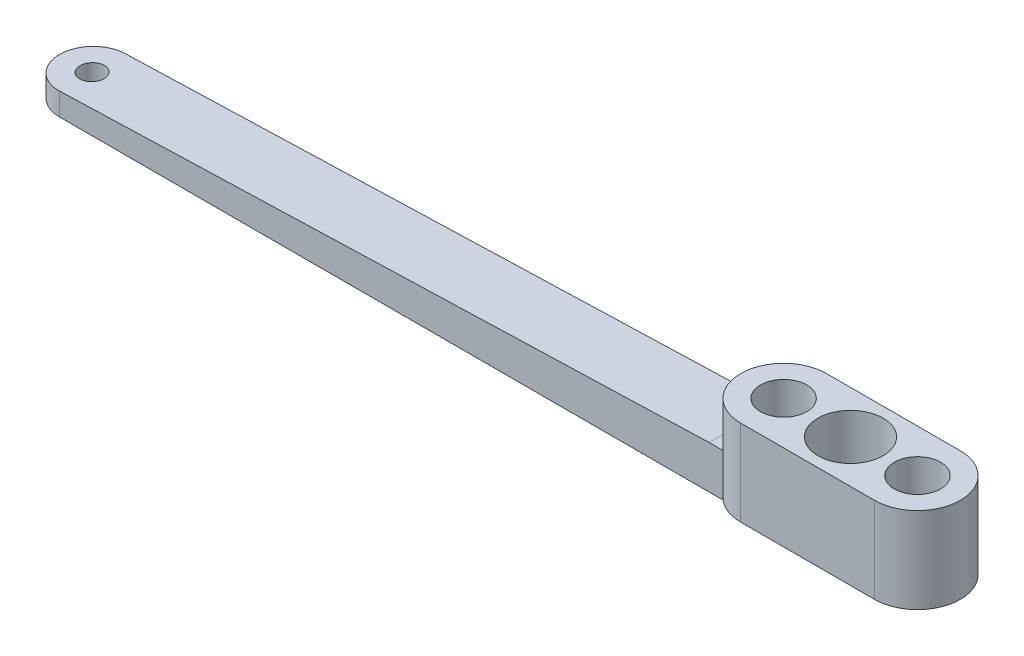
ISO-10303-21;
HEADER;
FILE_DESCRIPTION(('STEP AP214'),'2;1');
FILE_NAME('part.step','',(''),(''),'','','');
FILE_SCHEMA(('AUTOMOTIVE_DESIGN { 1 0 10303 214 1 1 1 1 }'));
ENDSEC;
DATA;
#1=APPLICATION_CONTEXT('core data for automotive mechanical design processes');
#2=APPLICATION_PROTOCOL_DEFINITION('international standard','automotive_design',2000,#1);
#3=PRODUCT_CONTEXT('',#1,'mechanical');
#4=PRODUCT('Part','Part','',(#3));
#5=PRODUCT_RELATED_PRODUCT_CATEGORY('part','',(#4));
#6=PRODUCT_DEFINITION_FORMATION('','',#4);
#7=PRODUCT_DEFINITION_CONTEXT('part definition',#1,'design');
#8=PRODUCT_DEFINITION('design','',#6,#7);
#9=PRODUCT_DEFINITION_SHAPE('','',#8);
#10=(LENGTH_UNIT() NAMED_UNIT(*) SI_UNIT(.MILLI.,.METRE.));
#11=(NAMED_UNIT(*) PLANE_ANGLE_UNIT() SI_UNIT($,.RADIAN.));
#12=(NAMED_UNIT(*) SI_UNIT($,.STERADIAN.) SOLID_ANGLE_UNIT());
#13=UNCERTAINTY_MEASURE_WITH_UNIT(LENGTH_MEASURE(1.E-05),#10,'distance_accuracy_value','');
#14=(GEOMETRIC_REPRESENTATION_CONTEXT(3) GLOBAL_UNCERTAINTY_ASSIGNED_CONTEXT((#13)) GLOBAL_UNIT_ASSIGNED_CONTEXT((#10,
#11,#12)) REPRESENTATION_CONTEXT('',''));
#15=CARTESIAN_POINT('',(0.,0.,0.));
#16=DIRECTION('',(0.,0.,1.));
#17=DIRECTION('',(1.,0.,0.));
#18=AXIS2_PLACEMENT_3D('',#15,#16,#17);
#19=CARTESIAN_POINT('',(0.,6.35,0.));
#20=DIRECTION('',(0.,1.,0.));
#21=DIRECTION('',(0.,0.,1.));
#22=AXIS2_PLACEMENT_3D('',#19,#20,#21);
#23=PLANE('',#22);
#24=DIRECTION('',(0.,0.,-1.));
#25=VECTOR('',#24,1.);
#26=CARTESIAN_POINT('',(-16.1103569011217,6.35,0.));
#27=LINE('',#26,#25);
#28=CARTESIAN_POINT('',(-16.1103569011217,6.35,4.82600000000001));
#29=VERTEX_POINT('',#28);
#30=CARTESIAN_POINT('',(-16.1103569011217,6.35,1.35220392082839));
#31=VERTEX_POINT('',#30);
#32=EDGE_CURVE('E11',#29,#31,#27,.T.);
#33=ORIENTED_EDGE('',*,*,#32,.F.);
#34=DIRECTION('',(1.,0.,0.));
#35=VECTOR('',#34,1.);
#36=CARTESIAN_POINT('',(0.,6.35,4.82600000000001));
#37=LINE('',#36,#35);
#38=CARTESIAN_POINT('',(-14.0330115095551,6.35,4.82600000000001));
#39=VERTEX_POINT('',#38);
#40=EDGE_CURVE('E63',#29,#39,#37,.T.);
#41=ORIENTED_EDGE('',*,*,#40,.T.);
#42=CARTESIAN_POINT('',(-9.906,6.35,0.));
#43=DIRECTION('',(0.,1.,0.));
#44=DIRECTION('',(0.,0.,1.));
#45=AXIS2_PLACEMENT_3D('',#42,#43,#44);
#46=CIRCLE('',#45,6.35);
#47=EDGE_CURVE('E149',#31,#39,#46,.T.);
#48=ORIENTED_EDGE('',*,*,#47,.F.);
#49=EDGE_LOOP('',(#33,#41,#48));
#50=FACE_BOUND('',#49,.T.);
#51=ADVANCED_FACE('F39',(#50),#23,.T.);
#52=CARTESIAN_POINT('',(-9.906,12.7,0.));
#53=DIRECTION('',(0.,1.,0.));
#54=DIRECTION('',(0.,0.,1.));
#55=AXIS2_PLACEMENT_3D('',#52,#53,#54);
#56=PLANE('',#55);
#57=CARTESIAN_POINT('',(9.906,12.7,0.));
#58=DIRECTION('',(0.,1.,0.));
#59=DIRECTION('',(0.,0.,1.));
#60=AXIS2_PLACEMENT_3D('',#57,#58,#59);
#61=CIRCLE('',#60,3.429);
#62=CARTESIAN_POINT('',(9.906,12.7,3.429));
#63=VERTEX_POINT('',#62);
#64=EDGE_CURVE('E193',#63,#63,#61,.T.);
#65=ORIENTED_EDGE('',*,*,#64,.F.);
#66=EDGE_LOOP('',(#65));
#67=FACE_BOUND('',#66,.T.);
#68=CARTESIAN_POINT('',(-9.906,12.7,0.));
#69=DIRECTION('',(0.,1.,0.));
#70=DIRECTION('',(0.,0.,1.));
#71=AXIS2_PLACEMENT_3D('',#68,#69,#70);
#72=CIRCLE('',#71,6.35);
#73=CARTESIAN_POINT('',(-9.906,12.7,-6.35));
#74=VERTEX_POINT('',#73);
#75=CARTESIAN_POINT('',(-9.906,12.7,6.35));
#76=VERTEX_POINT('',#75);
#77=EDGE_CURVE('E206',#74,#76,#72,.T.);
#78=ORIENTED_EDGE('',*,*,#77,.T.);
#79=DIRECTION('',(1.,0.,0.));
#80=VECTOR('',#79,1.);
#81=CARTESIAN_POINT('',(-9.906,12.7,6.35));
#82=LINE('',#81,#80);
#83=CARTESIAN_POINT('',(9.906,12.7,6.35));
#84=VERTEX_POINT('',#83);
#85=EDGE_CURVE('E210',#76,#84,#82,.T.);
#86=ORIENTED_EDGE('',*,*,#85,.T.);
#87=CARTESIAN_POINT('',(9.906,12.7,0.));
#88=DIRECTION('',(0.,1.,0.));
#89=DIRECTION('',(0.,0.,1.));
#90=AXIS2_PLACEMENT_3D('',#87,#88,#89);
#91=CIRCLE('',#90,6.35);
#92=CARTESIAN_POINT('',(9.906,12.7,-6.35));
#93=VERTEX_POINT('',#92);
#94=EDGE_CURVE('E214',#84,#93,#91,.T.);
#95=ORIENTED_EDGE('',*,*,#94,.T.);
#96=DIRECTION('',(-1.,0.,0.));
#97=VECTOR('',#96,1.);
#98=CARTESIAN_POINT('',(-9.906,12.7,-6.35));
#99=LINE('',#98,#97);
#100=EDGE_CURVE('E217',#93,#74,#99,.T.);
#101=ORIENTED_EDGE('',*,*,#100,.T.);
#102=EDGE_LOOP('',(#78,#86,#95,#101));
#103=FACE_BOUND('',#102,.T.);
#104=CARTESIAN_POINT('',(0.,12.7,0.));
#105=DIRECTION('',(0.,1.,0.));
#106=DIRECTION('',(0.,0.,1.));
#107=AXIS2_PLACEMENT_3D('',#104,#105,#106);
#108=CIRCLE('',#107,4.826);
#109=CARTESIAN_POINT('',(0.,12.7,4.826));
#110=VERTEX_POINT('',#109);
#111=EDGE_CURVE('E198',#110,#110,#108,.T.);
#112=ORIENTED_EDGE('',*,*,#111,.F.);
#113=EDGE_LOOP('',(#112));
#114=FACE_BOUND('',#113,.T.);
#115=CARTESIAN_POINT('',(-9.906,12.7,0.));
#116=DIRECTION('',(0.,1.,0.));
#117=DIRECTION('',(0.,0.,1.));
#118=AXIS2_PLACEMENT_3D('',#115,#116,#117);
#119=CIRCLE('',#118,3.429);
#120=CARTESIAN_POINT('',(-9.906,12.7,3.429));
#121=VERTEX_POINT('',#120);
#122=EDGE_CURVE('E186',#121,#121,#119,.T.);
#123=ORIENTED_EDGE('',*,*,#122,.F.);
#124=EDGE_LOOP('',(#123));
#125=FACE_BOUND('',#124,.T.);
#126=ADVANCED_FACE('F266',(#67,#103,#114,#125),#56,.T.);
#127=CARTESIAN_POINT('',(-9.906,0.,0.));
#128=DIRECTION('',(0.,1.,0.));
#129=DIRECTION('',(0.,0.,1.));
#130=AXIS2_PLACEMENT_3D('',#127,#128,#129);
#131=PLANE('',#130);
#132=CARTESIAN_POINT('',(-112.268,0.,0.));
#133=DIRECTION('',(0.,1.,0.));
#134=DIRECTION('',(0.,0.,1.));
#135=AXIS2_PLACEMENT_3D('',#132,#133,#134);
#136=CIRCLE('',#135,1.77800000000001);
#137=CARTESIAN_POINT('',(-112.268,0.,1.77800000000001));
#138=VERTEX_POINT('',#137);
#139=EDGE_CURVE('E377',#138,#138,#136,.T.);
#140=ORIENTED_EDGE('',*,*,#139,.T.);
#141=EDGE_LOOP('',(#140));
#142=FACE_BOUND('',#141,.T.);
#143=CARTESIAN_POINT('',(-9.906,0.,0.));
#144=DIRECTION('',(0.,1.,0.));
#145=DIRECTION('',(0.,0.,1.));
#146=AXIS2_PLACEMENT_3D('',#143,#144,#145);
#147=CIRCLE('',#146,6.35);
#148=CARTESIAN_POINT('',(-9.906,0.,-6.35));
#149=VERTEX_POINT('',#148);
#150=CARTESIAN_POINT('',(-14.0330115095551,0.,-4.82599999999999));
#151=VERTEX_POINT('',#150);
#152=EDGE_CURVE('E221',#149,#151,#147,.T.);
#153=ORIENTED_EDGE('',*,*,#152,.F.);
#154=DIRECTION('',(-1.,0.,0.));
#155=VECTOR('',#154,1.);
#156=CARTESIAN_POINT('',(-9.906,0.,-6.35));
#157=LINE('',#156,#155);
#158=CARTESIAN_POINT('',(9.906,0.,-6.35));
#159=VERTEX_POINT('',#158);
#160=EDGE_CURVE('E211',#159,#149,#157,.T.);
#161=ORIENTED_EDGE('',*,*,#160,.F.);
#162=CARTESIAN_POINT('',(9.906,0.,0.));
#163=DIRECTION('',(0.,1.,0.));
#164=DIRECTION('',(0.,0.,1.));
#165=AXIS2_PLACEMENT_3D('',#162,#163,#164);
#166=CIRCLE('',#165,6.35);
#167=CARTESIAN_POINT('',(9.906,0.,6.35));
#168=VERTEX_POINT('',#167);
#169=EDGE_CURVE('E227',#168,#159,#166,.T.);
#170=ORIENTED_EDGE('',*,*,#169,.F.);
#171=DIRECTION('',(1.,0.,0.));
#172=VECTOR('',#171,1.);
#173=CARTESIAN_POINT('',(-9.906,0.,6.35));
#174=LINE('',#173,#172);
#175=CARTESIAN_POINT('',(-9.906,0.,6.35));
#176=VERTEX_POINT('',#175);
#177=EDGE_CURVE('E224',#176,#168,#174,.T.);
#178=ORIENTED_EDGE('',*,*,#177,.F.);
#179=CARTESIAN_POINT('',(-14.0330115095551,0.,4.82600000000001));
#180=VERTEX_POINT('',#179);
#181=EDGE_CURVE('E202',#180,#176,#147,.T.);
#182=ORIENTED_EDGE('',*,*,#181,.F.);
#183=DIRECTION('',(1.,0.,0.));
#184=VECTOR('',#183,1.);
#185=CARTESIAN_POINT('',(0.,0.,4.82600000000001));
#186=LINE('',#185,#184);
#187=CARTESIAN_POINT('',(-112.268,0.,4.82600000000001));
#188=VERTEX_POINT('',#187);
#189=EDGE_CURVE('E158',#188,#180,#186,.T.);
#190=ORIENTED_EDGE('',*,*,#189,.F.);
#191=CARTESIAN_POINT('',(-112.268,0.,0.));
#192=DIRECTION('',(0.,1.,0.));
#193=DIRECTION('',(0.,0.,1.));
#194=AXIS2_PLACEMENT_3D('',#191,#192,#193);
#195=CIRCLE('',#194,4.826);
#196=CARTESIAN_POINT('',(-112.268,0.,-4.82599999999999));
#197=VERTEX_POINT('',#196);
#198=EDGE_CURVE('E154',#197,#188,#195,.T.);
#199=ORIENTED_EDGE('',*,*,#198,.F.);
#200=DIRECTION('',(1.,0.,0.));
#201=VECTOR('',#200,1.);
#202=CARTESIAN_POINT('',(0.,0.,-4.82599999999999));
#203=LINE('',#202,#201);
#204=EDGE_CURVE('E136',#197,#151,#203,.T.);
#205=ORIENTED_EDGE('',*,*,#204,.T.);
#206=EDGE_LOOP('',(#153,#161,#170,#178,#182,#190,#199,#205));
#207=FACE_BOUND('',#206,.T.);
#208=CARTESIAN_POINT('',(0.,0.,0.));
#209=DIRECTION('',(0.,1.,0.));
#210=DIRECTION('',(0.,0.,1.));
#211=AXIS2_PLACEMENT_3D('',#208,#209,#210);
#212=CIRCLE('',#211,4.826);
#213=CARTESIAN_POINT('',(0.,0.,4.826));
#214=VERTEX_POINT('',#213);
#215=EDGE_CURVE('E197',#214,#214,#212,.T.);
#216=ORIENTED_EDGE('',*,*,#215,.T.);
#217=EDGE_LOOP('',(#216));
#218=FACE_BOUND('',#217,.T.);
#219=CARTESIAN_POINT('',(-9.906,0.,0.));
#220=DIRECTION('',(0.,1.,0.));
#221=DIRECTION('',(0.,0.,1.));
#222=AXIS2_PLACEMENT_3D('',#219,#220,#221);
#223=CIRCLE('',#222,1.905);
#224=CARTESIAN_POINT('',(-9.906,0.,1.905));
#225=VERTEX_POINT('',#224);
#226=EDGE_CURVE('E178',#225,#225,#223,.T.);
#227=ORIENTED_EDGE('',*,*,#226,.T.);
#228=EDGE_LOOP('',(#227));
#229=FACE_BOUND('',#228,.T.);
#230=CARTESIAN_POINT('',(9.906,0.,0.));
#231=DIRECTION('',(0.,1.,0.));
#232=DIRECTION('',(0.,0.,1.));
#233=AXIS2_PLACEMENT_3D('',#230,#231,#232);
#234=CIRCLE('',#233,1.905);
#235=CARTESIAN_POINT('',(9.906,0.,1.905));
#236=VERTEX_POINT('',#235);
#237=EDGE_CURVE('E173',#236,#236,#234,.T.);
#238=ORIENTED_EDGE('',*,*,#237,.T.);
#239=EDGE_LOOP('',(#238));
#240=FACE_BOUND('',#239,.T.);
#241=ADVANCED_FACE('F269',(#142,#207,#218,#229,#240),#131,.F.);
#242=CARTESIAN_POINT('',(-9.906,12.7,0.));
#243=DIRECTION('',(0.,-1.,0.));
#244=DIRECTION('',(0.,0.,-1.));
#245=AXIS2_PLACEMENT_3D('',#242,#243,#244);
#246=CYLINDRICAL_SURFACE('',#245,6.35);
#247=ORIENTED_EDGE('',*,*,#152,.T.);
#248=DIRECTION('',(0.,-1.,0.));
#249=VECTOR('',#248,1.);
#250=CARTESIAN_POINT('',(-14.0330115095551,6.35,-4.82599999999999));
#251=LINE('',#250,#249);
#252=CARTESIAN_POINT('',(-14.0330115095551,6.35,-4.82599999999999));
#253=VERTEX_POINT('',#252);
#254=EDGE_CURVE('E170',#253,#151,#251,.T.);
#255=ORIENTED_EDGE('',*,*,#254,.F.);
#256=CARTESIAN_POINT('',(-16.1103569011217,6.35,-1.35220392082839));
#257=VERTEX_POINT('',#256);
#258=EDGE_CURVE('E140',#253,#257,#46,.T.);
#259=ORIENTED_EDGE('',*,*,#258,.T.);
#260=EDGE_CURVE('E147',#257,#31,#46,.T.);
#261=ORIENTED_EDGE('',*,*,#260,.T.);
#262=ORIENTED_EDGE('',*,*,#47,.T.);
#263=DIRECTION('',(0.,-1.,0.));
#264=VECTOR('',#263,1.);
#265=CARTESIAN_POINT('',(-14.0330115095551,6.35,4.82600000000001));
#266=LINE('',#265,#264);
#267=EDGE_CURVE('E145',#39,#180,#266,.T.);
#268=ORIENTED_EDGE('',*,*,#267,.T.);
#269=ORIENTED_EDGE('',*,*,#181,.T.);
#270=DIRECTION('',(0.,-1.,0.));
#271=VECTOR('',#270,1.);
#272=CARTESIAN_POINT('',(-9.906,12.7,6.35));
#273=LINE('',#272,#271);
#274=EDGE_CURVE('E243',#76,#176,#273,.T.);
#275=ORIENTED_EDGE('',*,*,#274,.F.);
#276=ORIENTED_EDGE('',*,*,#77,.F.);
#277=DIRECTION('',(0.,-1.,0.));
#278=VECTOR('',#277,1.);
#279=CARTESIAN_POINT('',(-9.906,12.7,-6.35));
#280=LINE('',#279,#278);
#281=EDGE_CURVE('E220',#74,#149,#280,.T.);
#282=ORIENTED_EDGE('',*,*,#281,.T.);
#283=EDGE_LOOP('',(#247,#255,#259,#261,#262,#268,#269,#275,#276,#282));
#284=FACE_BOUND('',#283,.T.);
#285=ADVANCED_FACE('F41',(#284),#246,.T.);
#286=CARTESIAN_POINT('',(-9.906,12.7,6.35));
#287=DIRECTION('',(0.,0.,-1.));
#288=DIRECTION('',(-1.,0.,0.));
#289=AXIS2_PLACEMENT_3D('',#286,#287,#288);
#290=PLANE('',#289);
#291=ORIENTED_EDGE('',*,*,#177,.T.);
#292=DIRECTION('',(0.,-1.,0.));
#293=VECTOR('',#292,1.);
#294=CARTESIAN_POINT('',(9.906,12.7,6.35));
#295=LINE('',#294,#293);
#296=EDGE_CURVE('E239',#84,#168,#295,.T.);
#297=ORIENTED_EDGE('',*,*,#296,.F.);
#298=ORIENTED_EDGE('',*,*,#85,.F.);
#299=ORIENTED_EDGE('',*,*,#274,.T.);
#300=EDGE_LOOP('',(#291,#297,#298,#299));
#301=FACE_BOUND('',#300,.T.);
#302=ADVANCED_FACE('F336',(#301),#290,.F.);
#303=CARTESIAN_POINT('',(9.906,12.7,0.));
#304=DIRECTION('',(0.,-1.,0.));
#305=DIRECTION('',(0.,0.,-1.));
#306=AXIS2_PLACEMENT_3D('',#303,#304,#305);
#307=CYLINDRICAL_SURFACE('',#306,6.35);
#308=ORIENTED_EDGE('',*,*,#169,.T.);
#309=DIRECTION('',(0.,-1.,0.));
#310=VECTOR('',#309,1.);
#311=CARTESIAN_POINT('',(9.906,12.7,-6.35));
#312=LINE('',#311,#310);
#313=EDGE_CURVE('E235',#93,#159,#312,.T.);
#314=ORIENTED_EDGE('',*,*,#313,.F.);
#315=ORIENTED_EDGE('',*,*,#94,.F.);
#316=ORIENTED_EDGE('',*,*,#296,.T.);
#317=EDGE_LOOP('',(#308,#314,#315,#316));
#318=FACE_BOUND('',#317,.T.);
#319=ADVANCED_FACE('F345',(#318),#307,.T.);
#320=CARTESIAN_POINT('',(-9.906,12.7,-6.35));
#321=DIRECTION('',(0.,0.,1.));
#322=DIRECTION('',(1.,0.,0.));
#323=AXIS2_PLACEMENT_3D('',#320,#321,#322);
#324=PLANE('',#323);
#325=ORIENTED_EDGE('',*,*,#160,.T.);
#326=ORIENTED_EDGE('',*,*,#281,.F.);
#327=ORIENTED_EDGE('',*,*,#100,.F.);
#328=ORIENTED_EDGE('',*,*,#313,.T.);
#329=EDGE_LOOP('',(#325,#326,#327,#328));
#330=FACE_BOUND('',#329,.T.);
#331=ADVANCED_FACE('F342',(#330),#324,.F.);
#332=CARTESIAN_POINT('',(0.,12.7,0.));
#333=DIRECTION('',(0.,-1.,0.));
#334=DIRECTION('',(0.,0.,-1.));
#335=AXIS2_PLACEMENT_3D('',#332,#333,#334);
#336=CYLINDRICAL_SURFACE('',#335,4.826);
#337=ORIENTED_EDGE('',*,*,#111,.T.);
#338=EDGE_LOOP('',(#337));
#339=FACE_BOUND('',#338,.T.);
#340=ORIENTED_EDGE('',*,*,#215,.F.);
#341=EDGE_LOOP('',(#340));
#342=FACE_BOUND('',#341,.T.);
#343=ADVANCED_FACE('F262',(#339,#342),#336,.F.);
#344=CARTESIAN_POINT('',(9.906,12.7,0.));
#345=DIRECTION('',(0.,-1.,0.));
#346=DIRECTION('',(0.,0.,-1.));
#347=AXIS2_PLACEMENT_3D('',#344,#345,#346);
#348=CYLINDRICAL_SURFACE('',#347,3.429);
#349=CARTESIAN_POINT('',(9.906,6.35,0.));
#350=DIRECTION('',(0.,1.,0.));
#351=DIRECTION('',(0.,0.,1.));
#352=AXIS2_PLACEMENT_3D('',#349,#350,#351);
#353=CIRCLE('',#352,3.429);
#354=CARTESIAN_POINT('',(9.906,6.35,3.429));
#355=VERTEX_POINT('',#354);
#356=EDGE_CURVE('E127',#355,#355,#353,.T.);
#357=ORIENTED_EDGE('',*,*,#356,.F.);
#358=EDGE_LOOP('',(#357));
#359=FACE_BOUND('',#358,.T.);
#360=ORIENTED_EDGE('',*,*,#64,.T.);
#361=EDGE_LOOP('',(#360));
#362=FACE_BOUND('',#361,.T.);
#363=ADVANCED_FACE('F258',(#359,#362),#348,.F.);
#364=CARTESIAN_POINT('',(-9.906,12.7,0.));
#365=DIRECTION('',(0.,-1.,0.));
#366=DIRECTION('',(0.,0.,-1.));
#367=AXIS2_PLACEMENT_3D('',#364,#365,#366);
#368=CYLINDRICAL_SURFACE('',#367,3.429);
#369=CARTESIAN_POINT('',(-9.906,6.35,0.));
#370=DIRECTION('',(0.,1.,0.));
#371=DIRECTION('',(0.,0.,1.));
#372=AXIS2_PLACEMENT_3D('',#369,#370,#371);
#373=CIRCLE('',#372,3.429);
#374=CARTESIAN_POINT('',(-9.906,6.35,3.429));
#375=VERTEX_POINT('',#374);
#376=EDGE_CURVE('E247',#375,#375,#373,.T.);
#377=ORIENTED_EDGE('',*,*,#376,.F.);
#378=EDGE_LOOP('',(#377));
#379=FACE_BOUND('',#378,.T.);
#380=ORIENTED_EDGE('',*,*,#122,.T.);
#381=EDGE_LOOP('',(#380));
#382=FACE_BOUND('',#381,.T.);
#383=ADVANCED_FACE('F261',(#379,#382),#368,.F.);
#384=CARTESIAN_POINT('',(-9.906,6.35,0.));
#385=DIRECTION('',(0.,1.,0.));
#386=DIRECTION('',(0.,0.,1.));
#387=AXIS2_PLACEMENT_3D('',#384,#385,#386);
#388=PLANE('',#387);
#389=ORIENTED_EDGE('',*,*,#376,.T.);
#390=EDGE_LOOP('',(#389));
#391=FACE_BOUND('',#390,.T.);
#392=CARTESIAN_POINT('',(-9.906,6.35,0.));
#393=DIRECTION('',(0.,1.,0.));
#394=DIRECTION('',(0.,0.,1.));
#395=AXIS2_PLACEMENT_3D('',#392,#393,#394);
#396=CIRCLE('',#395,1.905);
#397=CARTESIAN_POINT('',(-9.906,6.35,1.905));
#398=VERTEX_POINT('',#397);
#399=EDGE_CURVE('E182',#398,#398,#396,.T.);
#400=ORIENTED_EDGE('',*,*,#399,.F.);
#401=EDGE_LOOP('',(#400));
#402=FACE_BOUND('',#401,.T.);
#403=ADVANCED_FACE('F279',(#391,#402),#388,.T.);
#404=CARTESIAN_POINT('',(-9.906,6.35,0.));
#405=DIRECTION('',(0.,-1.,0.));
#406=DIRECTION('',(0.,0.,-1.));
#407=AXIS2_PLACEMENT_3D('',#404,#405,#406);
#408=CYLINDRICAL_SURFACE('',#407,1.905);
#409=ORIENTED_EDGE('',*,*,#399,.T.);
#410=EDGE_LOOP('',(#409));
#411=FACE_BOUND('',#410,.T.);
#412=ORIENTED_EDGE('',*,*,#226,.F.);
#413=EDGE_LOOP('',(#412));
#414=FACE_BOUND('',#413,.T.);
#415=ADVANCED_FACE('F285',(#411,#414),#408,.F.);
#416=CARTESIAN_POINT('',(9.906,6.35,0.));
#417=DIRECTION('',(0.,1.,0.));
#418=DIRECTION('',(0.,0.,1.));
#419=AXIS2_PLACEMENT_3D('',#416,#417,#418);
#420=PLANE('',#419);
#421=ORIENTED_EDGE('',*,*,#356,.T.);
#422=EDGE_LOOP('',(#421));
#423=FACE_BOUND('',#422,.T.);
#424=CARTESIAN_POINT('',(9.906,6.35,0.));
#425=DIRECTION('',(0.,1.,0.));
#426=DIRECTION('',(0.,0.,1.));
#427=AXIS2_PLACEMENT_3D('',#424,#425,#426);
#428=CIRCLE('',#427,1.905);
#429=CARTESIAN_POINT('',(9.906,6.35,1.905));
#430=VERTEX_POINT('',#429);
#431=EDGE_CURVE('E174',#430,#430,#428,.T.);
#432=ORIENTED_EDGE('',*,*,#431,.F.);
#433=EDGE_LOOP('',(#432));
#434=FACE_BOUND('',#433,.T.);
#435=ADVANCED_FACE('F255',(#423,#434),#420,.T.);
#436=CARTESIAN_POINT('',(9.906,6.35,0.));
#437=DIRECTION('',(0.,-1.,0.));
#438=DIRECTION('',(0.,0.,-1.));
#439=AXIS2_PLACEMENT_3D('',#436,#437,#438);
#440=CYLINDRICAL_SURFACE('',#439,1.905);
#441=ORIENTED_EDGE('',*,*,#431,.T.);
#442=EDGE_LOOP('',(#441));
#443=FACE_BOUND('',#442,.T.);
#444=ORIENTED_EDGE('',*,*,#237,.F.);
#445=EDGE_LOOP('',(#444));
#446=FACE_BOUND('',#445,.T.);
#447=ADVANCED_FACE('F313',(#443,#446),#440,.F.);
#448=CARTESIAN_POINT('',(0.,6.35,-4.82599999999999));
#449=DIRECTION('',(0.,0.,-1.));
#450=DIRECTION('',(-1.,0.,0.));
#451=AXIS2_PLACEMENT_3D('',#448,#449,#450);
#452=PLANE('',#451);
#453=DIRECTION('',(-0.999506106217205,-0.0314252069925062,0.));
#454=VECTOR('',#453,1.);
#455=CARTESIAN_POINT('',(-0.0159096804075781,6.85602125609325,-4.82599999999999));
#456=LINE('',#455,#454);
#457=CARTESIAN_POINT('',(-16.1103569011217,6.35,-4.82599999999999));
#458=VERTEX_POINT('',#457);
#459=CARTESIAN_POINT('',(-112.268,3.32673298892571,-4.82599999999999));
#460=VERTEX_POINT('',#459);
#461=EDGE_CURVE('E120',#458,#460,#456,.T.);
#462=ORIENTED_EDGE('',*,*,#461,.F.);
#463=DIRECTION('',(1.,0.,0.));
#464=VECTOR('',#463,1.);
#465=CARTESIAN_POINT('',(0.,6.35,-4.82599999999999));
#466=LINE('',#465,#464);
#467=EDGE_CURVE('E131',#458,#253,#466,.T.);
#468=ORIENTED_EDGE('',*,*,#467,.T.);
#469=ORIENTED_EDGE('',*,*,#254,.T.);
#470=ORIENTED_EDGE('',*,*,#204,.F.);
#471=DIRECTION('',(0.,-1.,0.));
#472=VECTOR('',#471,1.);
#473=CARTESIAN_POINT('',(-112.268,6.35,-4.82599999999999));
#474=LINE('',#473,#472);
#475=EDGE_CURVE('E134',#460,#197,#474,.T.);
#476=ORIENTED_EDGE('',*,*,#475,.F.);
#477=EDGE_LOOP('',(#462,#468,#469,#470,#476));
#478=FACE_BOUND('',#477,.T.);
#479=ADVANCED_FACE('F129',(#478),#452,.T.);
#480=CARTESIAN_POINT('',(-112.268,6.35,0.));
#481=DIRECTION('',(0.,-1.,0.));
#482=DIRECTION('',(0.,0.,-1.));
#483=AXIS2_PLACEMENT_3D('',#480,#481,#482);
#484=CYLINDRICAL_SURFACE('',#483,4.826);
#485=CARTESIAN_POINT('',(-112.268,3.32673298892571,0.));
#486=DIRECTION('',(0.0314252069925062,-0.999506106217205,0.));
#487=DIRECTION('',(-0.999506106217205,-0.0314252069925062,0.));
#488=AXIS2_PLACEMENT_3D('',#485,#486,#487);
#489=ELLIPSE('',#488,4.82838470918881,4.826);
#490=CARTESIAN_POINT('',(-112.268,3.32673298892571,4.82600000000001));
#491=VERTEX_POINT('',#490);
#492=EDGE_CURVE('E137',#491,#460,#489,.T.);
#493=ORIENTED_EDGE('',*,*,#492,.T.);
#494=ORIENTED_EDGE('',*,*,#475,.T.);
#495=ORIENTED_EDGE('',*,*,#198,.T.);
#496=DIRECTION('',(0.,-1.,0.));
#497=VECTOR('',#496,1.);
#498=CARTESIAN_POINT('',(-112.268,6.35,4.82600000000001));
#499=LINE('',#498,#497);
#500=EDGE_CURVE('E165',#491,#188,#499,.T.);
#501=ORIENTED_EDGE('',*,*,#500,.F.);
#502=EDGE_LOOP('',(#493,#494,#495,#501));
#503=FACE_BOUND('',#502,.T.);
#504=ADVANCED_FACE('F303',(#503),#484,.T.);
#505=CARTESIAN_POINT('',(0.,6.35,4.82600000000001));
#506=DIRECTION('',(0.,0.,-1.));
#507=DIRECTION('',(-1.,0.,0.));
#508=AXIS2_PLACEMENT_3D('',#505,#506,#507);
#509=PLANE('',#508);
#510=ORIENTED_EDGE('',*,*,#40,.F.);
#511=DIRECTION('',(-0.999506106217205,-0.0314252069925062,0.));
#512=VECTOR('',#511,1.);
#513=CARTESIAN_POINT('',(-0.0159096804075781,6.85602125609325,4.82600000000001));
#514=LINE('',#513,#512);
#515=EDGE_CURVE('E369',#29,#491,#514,.T.);
#516=ORIENTED_EDGE('',*,*,#515,.T.);
#517=ORIENTED_EDGE('',*,*,#500,.T.);
#518=ORIENTED_EDGE('',*,*,#189,.T.);
#519=ORIENTED_EDGE('',*,*,#267,.F.);
#520=EDGE_LOOP('',(#510,#516,#517,#518,#519));
#521=FACE_BOUND('',#520,.T.);
#522=ADVANCED_FACE('F297',(#521),#509,.F.);
#523=EDGE_CURVE('E49',#257,#458,#27,.T.);
#524=ORIENTED_EDGE('',*,*,#523,.F.);
#525=ORIENTED_EDGE('',*,*,#258,.F.);
#526=ORIENTED_EDGE('',*,*,#467,.F.);
#527=EDGE_LOOP('',(#524,#525,#526));
#528=FACE_BOUND('',#527,.T.);
#529=ADVANCED_FACE('F139',(#528),#23,.T.);
#530=CARTESIAN_POINT('',(0.,6.35,-6.35));
#531=DIRECTION('',(0.,-1.,0.));
#532=DIRECTION('',(0.,0.,-1.));
#533=AXIS2_PLACEMENT_3D('',#530,#531,#532);
#534=PLANE('',#533);
#535=ORIENTED_EDGE('',*,*,#260,.F.);
#536=DIRECTION('',(0.,0.,1.));
#537=VECTOR('',#536,1.);
#538=CARTESIAN_POINT('',(-16.1103569011217,6.35,-6.35));
#539=LINE('',#538,#537);
#540=EDGE_CURVE('E55',#257,#31,#539,.T.);
#541=ORIENTED_EDGE('',*,*,#540,.T.);
#542=EDGE_LOOP('',(#535,#541));
#543=FACE_BOUND('',#542,.T.);
#544=ADVANCED_FACE('F296',(#543),#534,.T.);
#545=CARTESIAN_POINT('',(-0.215361188273828,6.84975035401404,-6.35));
#546=DIRECTION('',(0.0314252069925062,-0.999506106217205,0.));
#547=DIRECTION('',(0.999506106217205,0.0314252069925062,0.));
#548=AXIS2_PLACEMENT_3D('',#545,#546,#547);
#549=PLANE('',#548);
#550=CARTESIAN_POINT('',(-112.268,3.32673298892571,0.));
#551=DIRECTION('',(0.0314252069925062,-0.999506106217205,0.));
#552=DIRECTION('',(-0.999506106217205,-0.0314252069925062,0.));
#553=AXIS2_PLACEMENT_3D('',#550,#551,#552);
#554=ELLIPSE('',#553,1.77887857706957,1.77800000000001);
#555=CARTESIAN_POINT('',(-114.046,3.27083136142677,0.));
#556=VERTEX_POINT('',#555);
#557=EDGE_CURVE('E43',#556,#556,#554,.F.);
#558=ORIENTED_EDGE('',*,*,#557,.F.);
#559=EDGE_LOOP('',(#558));
#560=FACE_BOUND('',#559,.T.);
#561=ORIENTED_EDGE('',*,*,#461,.T.);
#562=ORIENTED_EDGE('',*,*,#492,.F.);
#563=ORIENTED_EDGE('',*,*,#515,.F.);
#564=ORIENTED_EDGE('',*,*,#32,.T.);
#565=ORIENTED_EDGE('',*,*,#540,.F.);
#566=ORIENTED_EDGE('',*,*,#523,.T.);
#567=EDGE_LOOP('',(#561,#562,#563,#564,#565,#566));
#568=FACE_BOUND('',#567,.T.);
#569=ADVANCED_FACE('F119',(#560,#568),#549,.F.);
#570=CARTESIAN_POINT('',(-112.268,6.35,0.));
#571=DIRECTION('',(0.,-1.,0.));
#572=DIRECTION('',(0.,0.,-1.));
#573=AXIS2_PLACEMENT_3D('',#570,#571,#572);
#574=CYLINDRICAL_SURFACE('',#573,1.77800000000001);
#575=ORIENTED_EDGE('',*,*,#139,.F.);
#576=EDGE_LOOP('',(#575));
#577=FACE_BOUND('',#576,.T.);
#578=ORIENTED_EDGE('',*,*,#557,.T.);
#579=EDGE_LOOP('',(#578));
#580=FACE_BOUND('',#579,.T.);
#581=ADVANCED_FACE('F384',(#577,#580),#574,.F.);
#582=CLOSED_SHELL('',(#51,#126,#241,#285,#302,#319,#331,#343,#363,#383,#403,#415,#435,#447,#479,
#504,#522,#529,#544,#569,#581));
#583=MANIFOLD_SOLID_BREP('B2',#582);
#584=ADVANCED_BREP_SHAPE_REPRESENTATION('',(#18,#583),#14);
#585=SHAPE_DEFINITION_REPRESENTATION(#9,#584);
ENDSEC;
END-ISO-10303-21;
